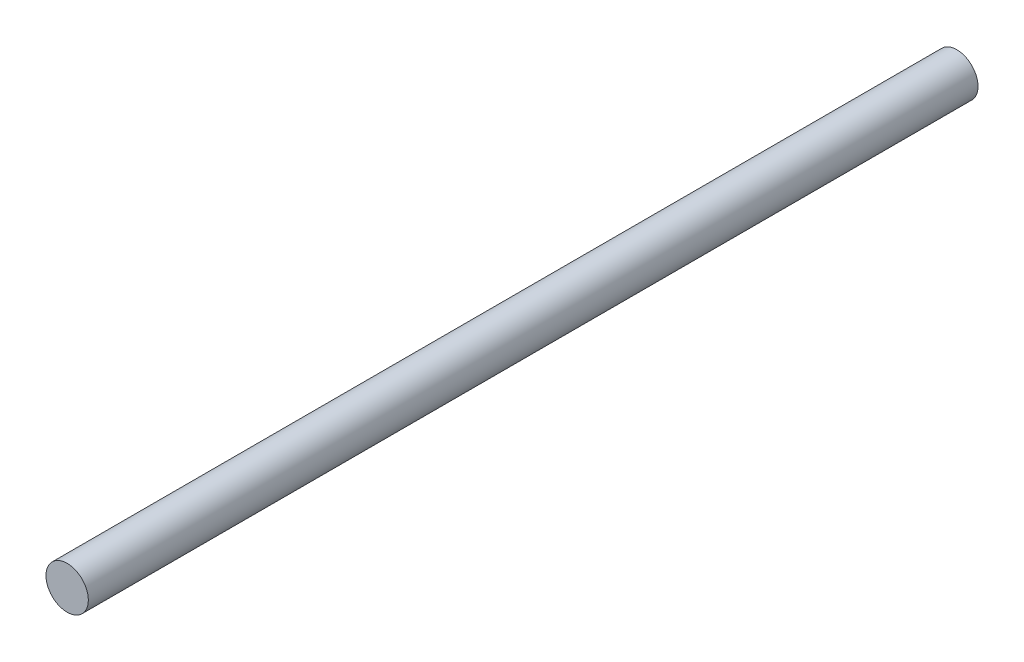
ISO-10303-21;
HEADER;
FILE_DESCRIPTION(('STEP AP214'),'2;1');
FILE_NAME('part.step','',(''),(''),'','','');
FILE_SCHEMA(('AUTOMOTIVE_DESIGN { 1 0 10303 214 1 1 1 1 }'));
ENDSEC;
DATA;
#1=APPLICATION_CONTEXT('core data for automotive mechanical design processes');
#2=APPLICATION_PROTOCOL_DEFINITION('international standard','automotive_design',2000,#1);
#3=PRODUCT_CONTEXT('',#1,'mechanical');
#4=PRODUCT('Part','Part','',(#3));
#5=PRODUCT_RELATED_PRODUCT_CATEGORY('part','',(#4));
#6=PRODUCT_DEFINITION_FORMATION('','',#4);
#7=PRODUCT_DEFINITION_CONTEXT('part definition',#1,'design');
#8=PRODUCT_DEFINITION('design','',#6,#7);
#9=PRODUCT_DEFINITION_SHAPE('','',#8);
#10=(LENGTH_UNIT() NAMED_UNIT(*) SI_UNIT(.MILLI.,.METRE.));
#11=(NAMED_UNIT(*) PLANE_ANGLE_UNIT() SI_UNIT($,.RADIAN.));
#12=(NAMED_UNIT(*) SI_UNIT($,.STERADIAN.) SOLID_ANGLE_UNIT());
#13=UNCERTAINTY_MEASURE_WITH_UNIT(LENGTH_MEASURE(1.E-05),#10,'distance_accuracy_value','');
#14=(GEOMETRIC_REPRESENTATION_CONTEXT(3) GLOBAL_UNCERTAINTY_ASSIGNED_CONTEXT((#13)) GLOBAL_UNIT_ASSIGNED_CONTEXT((#10,
#11,#12)) REPRESENTATION_CONTEXT('',''));
#15=CARTESIAN_POINT('',(0.,0.,0.));
#16=DIRECTION('',(0.,0.,1.));
#17=DIRECTION('',(1.,0.,0.));
#18=AXIS2_PLACEMENT_3D('',#15,#16,#17);
#19=CARTESIAN_POINT('',(0.,0.,21.));
#20=DIRECTION('',(0.,0.,-1.));
#21=DIRECTION('',(-1.,0.,0.));
#22=AXIS2_PLACEMENT_3D('',#19,#20,#21);
#23=CYLINDRICAL_SURFACE('',#22,0.5);
#24=CARTESIAN_POINT('',(0.,0.,21.));
#25=DIRECTION('',(0.,0.,1.));
#26=DIRECTION('',(1.,0.,0.));
#27=AXIS2_PLACEMENT_3D('',#24,#25,#26);
#28=CIRCLE('',#27,0.5);
#29=CARTESIAN_POINT('',(0.5,0.,21.));
#30=VERTEX_POINT('',#29);
#31=EDGE_CURVE('E10',#30,#30,#28,.T.);
#32=ORIENTED_EDGE('',*,*,#31,.F.);
#33=EDGE_LOOP('',(#32));
#34=FACE_BOUND('',#33,.T.);
#35=CARTESIAN_POINT('',(0.,0.,0.));
#36=DIRECTION('',(0.,0.,1.));
#37=DIRECTION('',(1.,0.,0.));
#38=AXIS2_PLACEMENT_3D('',#35,#36,#37);
#39=CIRCLE('',#38,0.5);
#40=CARTESIAN_POINT('',(0.5,0.,0.));
#41=VERTEX_POINT('',#40);
#42=EDGE_CURVE('E34',#41,#41,#39,.T.);
#43=ORIENTED_EDGE('',*,*,#42,.T.);
#44=EDGE_LOOP('',(#43));
#45=FACE_BOUND('',#44,.T.);
#46=ADVANCED_FACE('F31',(#34,#45),#23,.T.);
#47=CARTESIAN_POINT('',(0.,0.,21.));
#48=DIRECTION('',(0.,0.,1.));
#49=DIRECTION('',(1.,0.,0.));
#50=AXIS2_PLACEMENT_3D('',#47,#48,#49);
#51=PLANE('',#50);
#52=ORIENTED_EDGE('',*,*,#31,.T.);
#53=EDGE_LOOP('',(#52));
#54=FACE_BOUND('',#53,.T.);
#55=ADVANCED_FACE('F46',(#54),#51,.T.);
#56=CARTESIAN_POINT('',(0.,0.,0.));
#57=DIRECTION('',(0.,0.,1.));
#58=DIRECTION('',(1.,0.,0.));
#59=AXIS2_PLACEMENT_3D('',#56,#57,#58);
#60=PLANE('',#59);
#61=ORIENTED_EDGE('',*,*,#42,.F.);
#62=EDGE_LOOP('',(#61));
#63=FACE_BOUND('',#62,.T.);
#64=ADVANCED_FACE('F44',(#63),#60,.F.);
#65=CLOSED_SHELL('',(#46,#55,#64));
#66=MANIFOLD_SOLID_BREP('B2',#65);
#67=ADVANCED_BREP_SHAPE_REPRESENTATION('',(#18,#66),#14);
#68=SHAPE_DEFINITION_REPRESENTATION(#9,#67);
ENDSEC;
END-ISO-10303-21;
